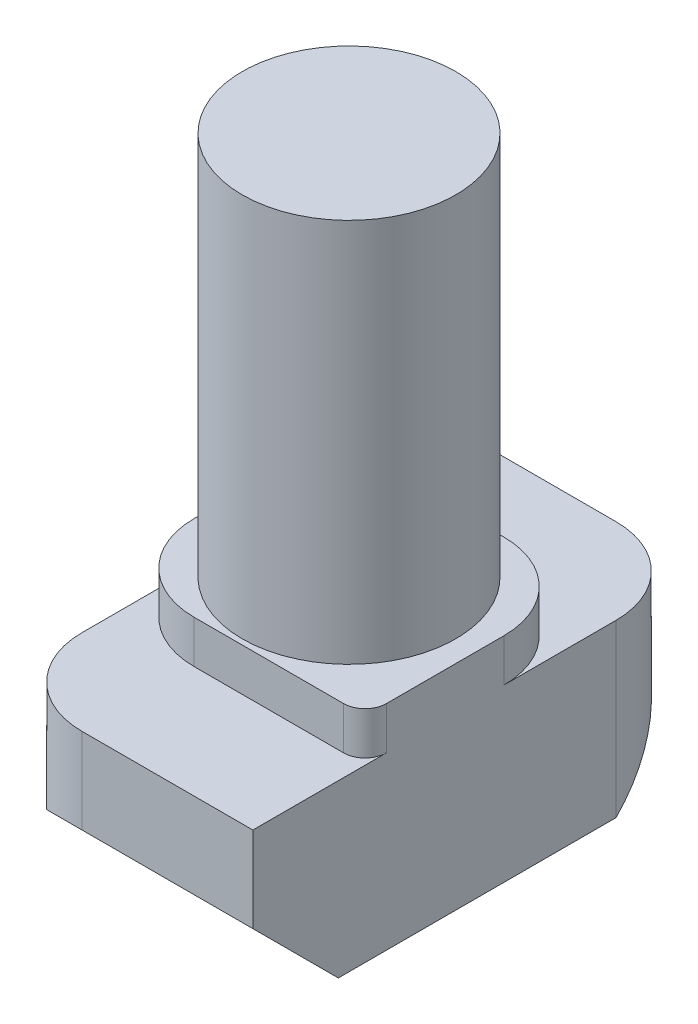
ISO-10303-21;
HEADER;
FILE_DESCRIPTION(('STEP AP214'),'2;1');
FILE_NAME('part.step','',(''),(''),'','','');
FILE_SCHEMA(('AUTOMOTIVE_DESIGN { 1 0 10303 214 1 1 1 1 }'));
ENDSEC;
DATA;
#1=APPLICATION_CONTEXT('core data for automotive mechanical design processes');
#2=APPLICATION_PROTOCOL_DEFINITION('international standard','automotive_design',2000,#1);
#3=PRODUCT_CONTEXT('',#1,'mechanical');
#4=PRODUCT('Part','Part','',(#3));
#5=PRODUCT_RELATED_PRODUCT_CATEGORY('part','',(#4));
#6=PRODUCT_DEFINITION_FORMATION('','',#4);
#7=PRODUCT_DEFINITION_CONTEXT('part definition',#1,'design');
#8=PRODUCT_DEFINITION('design','',#6,#7);
#9=PRODUCT_DEFINITION_SHAPE('','',#8);
#10=(LENGTH_UNIT() NAMED_UNIT(*) SI_UNIT(.MILLI.,.METRE.));
#11=(NAMED_UNIT(*) PLANE_ANGLE_UNIT() SI_UNIT($,.RADIAN.));
#12=(NAMED_UNIT(*) SI_UNIT($,.STERADIAN.) SOLID_ANGLE_UNIT());
#13=UNCERTAINTY_MEASURE_WITH_UNIT(LENGTH_MEASURE(1.E-05),#10,'distance_accuracy_value','');
#14=(GEOMETRIC_REPRESENTATION_CONTEXT(3) GLOBAL_UNCERTAINTY_ASSIGNED_CONTEXT((#13)) GLOBAL_UNIT_ASSIGNED_CONTEXT((#10,
#11,#12)) REPRESENTATION_CONTEXT('',''));
#15=CARTESIAN_POINT('',(0.,0.,0.));
#16=DIRECTION('',(0.,0.,1.));
#17=DIRECTION('',(1.,0.,0.));
#18=AXIS2_PLACEMENT_3D('',#15,#16,#17);
#19=CARTESIAN_POINT('',(3.,0.,2.625));
#20=DIRECTION('',(0.,-1.,0.));
#21=DIRECTION('',(0.,0.,-1.));
#22=AXIS2_PLACEMENT_3D('',#19,#20,#21);
#23=PLANE('',#22);
#24=DIRECTION('',(-1.,0.,0.));
#25=VECTOR('',#24,1.);
#26=CARTESIAN_POINT('',(3.,0.,-2.625));
#27=LINE('',#26,#25);
#28=CARTESIAN_POINT('',(1.,0.,-2.625));
#29=VERTEX_POINT('',#28);
#30=CARTESIAN_POINT('',(-2.5,0.,-2.625));
#31=VERTEX_POINT('',#30);
#32=EDGE_CURVE('E193',#29,#31,#27,.T.);
#33=ORIENTED_EDGE('',*,*,#32,.T.);
#34=CARTESIAN_POINT('',(-2.5,0.,-2.125));
#35=DIRECTION('',(0.,-1.,0.));
#36=DIRECTION('',(0.,0.,-1.));
#37=AXIS2_PLACEMENT_3D('',#34,#35,#36);
#38=CIRCLE('',#37,0.5);
#39=CARTESIAN_POINT('',(-3.,0.,-2.125));
#40=VERTEX_POINT('',#39);
#41=EDGE_CURVE('E254',#31,#40,#38,.F.);
#42=ORIENTED_EDGE('',*,*,#41,.T.);
#43=DIRECTION('',(0.,0.,1.));
#44=VECTOR('',#43,1.);
#45=CARTESIAN_POINT('',(-3.,0.,2.625));
#46=LINE('',#45,#44);
#47=CARTESIAN_POINT('',(-3.,0.,0.625000000000001));
#48=VERTEX_POINT('',#47);
#49=EDGE_CURVE('E148',#40,#48,#46,.T.);
#50=ORIENTED_EDGE('',*,*,#49,.T.);
#51=CARTESIAN_POINT('',(-1.,0.,0.625));
#52=DIRECTION('',(0.,-1.,0.));
#53=DIRECTION('',(0.,0.,-1.));
#54=AXIS2_PLACEMENT_3D('',#51,#52,#53);
#55=CIRCLE('',#54,2.);
#56=CARTESIAN_POINT('',(-1.,0.,2.625));
#57=VERTEX_POINT('',#56);
#58=EDGE_CURVE('E230',#48,#57,#55,.F.);
#59=ORIENTED_EDGE('',*,*,#58,.T.);
#60=DIRECTION('',(-1.,0.,0.));
#61=VECTOR('',#60,1.);
#62=CARTESIAN_POINT('',(3.,0.,2.625));
#63=LINE('',#62,#61);
#64=CARTESIAN_POINT('',(2.5,0.,2.625));
#65=VERTEX_POINT('',#64);
#66=EDGE_CURVE('E177',#65,#57,#63,.T.);
#67=ORIENTED_EDGE('',*,*,#66,.F.);
#68=CARTESIAN_POINT('',(2.5,0.,2.125));
#69=DIRECTION('',(0.,-1.,0.));
#70=DIRECTION('',(0.,0.,-1.));
#71=AXIS2_PLACEMENT_3D('',#68,#69,#70);
#72=CIRCLE('',#71,0.5);
#73=CARTESIAN_POINT('',(3.,0.,2.125));
#74=VERTEX_POINT('',#73);
#75=EDGE_CURVE('E252',#65,#74,#72,.F.);
#76=ORIENTED_EDGE('',*,*,#75,.T.);
#77=DIRECTION('',(0.,0.,1.));
#78=VECTOR('',#77,1.);
#79=CARTESIAN_POINT('',(3.,0.,2.625));
#80=LINE('',#79,#78);
#81=CARTESIAN_POINT('',(3.,0.,-0.624999999999999));
#82=VERTEX_POINT('',#81);
#83=EDGE_CURVE('E175',#82,#74,#80,.T.);
#84=ORIENTED_EDGE('',*,*,#83,.F.);
#85=CARTESIAN_POINT('',(1.,0.,-0.625));
#86=DIRECTION('',(0.,-1.,0.));
#87=DIRECTION('',(0.,0.,-1.));
#88=AXIS2_PLACEMENT_3D('',#85,#86,#87);
#89=CIRCLE('',#88,2.);
#90=EDGE_CURVE('E233',#82,#29,#89,.F.);
#91=ORIENTED_EDGE('',*,*,#90,.T.);
#92=EDGE_LOOP('',(#33,#42,#50,#59,#67,#76,#84,#91));
#93=FACE_BOUND('',#92,.T.);
#94=CARTESIAN_POINT('',(0.,0.,0.));
#95=DIRECTION('',(0.,-1.,0.));
#96=DIRECTION('',(0.,0.,-1.));
#97=AXIS2_PLACEMENT_3D('',#94,#95,#96);
#98=CIRCLE('',#97,2.5);
#99=CARTESIAN_POINT('',(0.,0.,-2.5));
#100=VERTEX_POINT('',#99);
#101=EDGE_CURVE('E11',#100,#100,#98,.F.);
#102=ORIENTED_EDGE('',*,*,#101,.F.);
#103=EDGE_LOOP('',(#102));
#104=FACE_BOUND('',#103,.T.);
#105=ADVANCED_FACE('F38',(#93,#104),#23,.F.);
#106=CARTESIAN_POINT('',(3.,-1.,2.625));
#107=DIRECTION('',(0.,0.,-1.));
#108=DIRECTION('',(-1.,0.,0.));
#109=AXIS2_PLACEMENT_3D('',#106,#107,#108);
#110=PLANE('',#109);
#111=DIRECTION('',(-1.,0.,0.));
#112=VECTOR('',#111,1.);
#113=CARTESIAN_POINT('',(3.,-1.,2.625));
#114=LINE('',#113,#112);
#115=CARTESIAN_POINT('',(2.5,-1.,2.625));
#116=VERTEX_POINT('',#115);
#117=CARTESIAN_POINT('',(-1.,-1.,2.625));
#118=VERTEX_POINT('',#117);
#119=EDGE_CURVE('E159',#116,#118,#114,.T.);
#120=ORIENTED_EDGE('',*,*,#119,.F.);
#121=DIRECTION('',(0.,-1.,0.));
#122=VECTOR('',#121,1.);
#123=CARTESIAN_POINT('',(2.5,-1.,2.625));
#124=LINE('',#123,#122);
#125=EDGE_CURVE('E260',#116,#65,#124,.F.);
#126=ORIENTED_EDGE('',*,*,#125,.T.);
#127=ORIENTED_EDGE('',*,*,#66,.T.);
#128=DIRECTION('',(0.,-1.,0.));
#129=VECTOR('',#128,1.);
#130=CARTESIAN_POINT('',(-1.,-1.,2.625));
#131=LINE('',#130,#129);
#132=EDGE_CURVE('E237',#57,#118,#131,.T.);
#133=ORIENTED_EDGE('',*,*,#132,.T.);
#134=EDGE_LOOP('',(#120,#126,#127,#133));
#135=FACE_BOUND('',#134,.T.);
#136=ADVANCED_FACE('F295',(#135),#110,.F.);
#137=CARTESIAN_POINT('',(3.,-1.,5.25));
#138=DIRECTION('',(0.,-1.,0.));
#139=DIRECTION('',(0.,0.,-1.));
#140=AXIS2_PLACEMENT_3D('',#137,#138,#139);
#141=PLANE('',#140);
#142=DIRECTION('',(0.,0.,1.));
#143=VECTOR('',#142,1.);
#144=CARTESIAN_POINT('',(-3.,-1.,5.25));
#145=LINE('',#144,#143);
#146=CARTESIAN_POINT('',(-3.,-1.,0.625));
#147=VERTEX_POINT('',#146);
#148=CARTESIAN_POINT('',(-3.,-1.,3.25));
#149=VERTEX_POINT('',#148);
#150=EDGE_CURVE('E178',#147,#149,#145,.T.);
#151=ORIENTED_EDGE('',*,*,#150,.T.);
#152=CARTESIAN_POINT('',(-1.,-1.,3.25));
#153=DIRECTION('',(0.,-1.,0.));
#154=DIRECTION('',(0.,0.,-1.));
#155=AXIS2_PLACEMENT_3D('',#152,#153,#154);
#156=CIRCLE('',#155,2.);
#157=CARTESIAN_POINT('',(-1.,-1.,5.25));
#158=VERTEX_POINT('',#157);
#159=EDGE_CURVE('E155',#149,#158,#156,.F.);
#160=ORIENTED_EDGE('',*,*,#159,.T.);
#161=DIRECTION('',(-1.,0.,0.));
#162=VECTOR('',#161,1.);
#163=CARTESIAN_POINT('',(3.,-1.,5.25));
#164=LINE('',#163,#162);
#165=CARTESIAN_POINT('',(3.,-1.,5.25));
#166=VERTEX_POINT('',#165);
#167=EDGE_CURVE('E151',#166,#158,#164,.T.);
#168=ORIENTED_EDGE('',*,*,#167,.F.);
#169=DIRECTION('',(0.,0.,1.));
#170=VECTOR('',#169,1.);
#171=CARTESIAN_POINT('',(3.,-1.,5.25));
#172=LINE('',#171,#170);
#173=CARTESIAN_POINT('',(3.,-1.,2.125));
#174=VERTEX_POINT('',#173);
#175=EDGE_CURVE('E57',#174,#166,#172,.T.);
#176=ORIENTED_EDGE('',*,*,#175,.F.);
#177=CARTESIAN_POINT('',(2.5,-1.,2.125));
#178=DIRECTION('',(0.,-1.,0.));
#179=DIRECTION('',(0.,0.,-1.));
#180=AXIS2_PLACEMENT_3D('',#177,#178,#179);
#181=CIRCLE('',#180,0.5);
#182=EDGE_CURVE('E46',#174,#116,#181,.T.);
#183=ORIENTED_EDGE('',*,*,#182,.T.);
#184=ORIENTED_EDGE('',*,*,#119,.T.);
#185=CARTESIAN_POINT('',(-1.,-1.,0.625));
#186=DIRECTION('',(0.,-1.,0.));
#187=DIRECTION('',(0.,0.,-1.));
#188=AXIS2_PLACEMENT_3D('',#185,#186,#187);
#189=CIRCLE('',#188,2.);
#190=EDGE_CURVE('E246',#118,#147,#189,.T.);
#191=ORIENTED_EDGE('',*,*,#190,.T.);
#192=EDGE_LOOP('',(#151,#160,#168,#176,#183,#184,#191));
#193=FACE_BOUND('',#192,.T.);
#194=ADVANCED_FACE('F153',(#193),#141,.F.);
#195=CARTESIAN_POINT('',(3.,-3.,5.25));
#196=DIRECTION('',(0.,0.,-1.));
#197=DIRECTION('',(-1.,0.,0.));
#198=AXIS2_PLACEMENT_3D('',#195,#196,#197);
#199=PLANE('',#198);
#200=ORIENTED_EDGE('',*,*,#167,.T.);
#201=DIRECTION('',(0.,-1.,0.));
#202=VECTOR('',#201,1.);
#203=CARTESIAN_POINT('',(-1.,-3.,5.25));
#204=LINE('',#203,#202);
#205=CARTESIAN_POINT('',(-1.,-3.,5.25));
#206=VERTEX_POINT('',#205);
#207=EDGE_CURVE('E220',#158,#206,#204,.T.);
#208=ORIENTED_EDGE('',*,*,#207,.T.);
#209=DIRECTION('',(-1.,0.,0.));
#210=VECTOR('',#209,1.);
#211=CARTESIAN_POINT('',(3.,-3.,5.25));
#212=LINE('',#211,#210);
#213=CARTESIAN_POINT('',(3.,-3.,5.25));
#214=VERTEX_POINT('',#213);
#215=EDGE_CURVE('E160',#214,#206,#212,.T.);
#216=ORIENTED_EDGE('',*,*,#215,.F.);
#217=DIRECTION('',(0.,-1.,0.));
#218=VECTOR('',#217,1.);
#219=CARTESIAN_POINT('',(3.,-3.,5.25));
#220=LINE('',#219,#218);
#221=EDGE_CURVE('E144',#166,#214,#220,.T.);
#222=ORIENTED_EDGE('',*,*,#221,.F.);
#223=EDGE_LOOP('',(#200,#208,#216,#222));
#224=FACE_BOUND('',#223,.T.);
#225=ADVANCED_FACE('F162',(#224),#199,.F.);
#226=CARTESIAN_POINT('',(3.,-5.,3.25));
#227=DIRECTION('',(0.,0.707106781186546,-0.707106781186549));
#228=DIRECTION('',(0.,0.707106781186549,0.707106781186546));
#229=AXIS2_PLACEMENT_3D('',#226,#227,#228);
#230=PLANE('',#229);
#231=ORIENTED_EDGE('',*,*,#215,.T.);
#232=CARTESIAN_POINT('',(-1.,-5.00000000000001,3.25));
#233=DIRECTION('',(0.,0.707106781186546,-0.707106781186549));
#234=DIRECTION('',(0.,0.707106781186549,0.707106781186546));
#235=AXIS2_PLACEMENT_3D('',#232,#233,#234);
#236=ELLIPSE('',#235,2.82842712474619,2.);
#237=CARTESIAN_POINT('',(-3.,-5.,3.25));
#238=VERTEX_POINT('',#237);
#239=EDGE_CURVE('E222',#206,#238,#236,.F.);
#240=ORIENTED_EDGE('',*,*,#239,.T.);
#241=DIRECTION('',(-1.,0.,0.));
#242=VECTOR('',#241,1.);
#243=CARTESIAN_POINT('',(3.,-5.,3.25));
#244=LINE('',#243,#242);
#245=CARTESIAN_POINT('',(3.,-5.,3.25));
#246=VERTEX_POINT('',#245);
#247=EDGE_CURVE('E206',#246,#238,#244,.T.);
#248=ORIENTED_EDGE('',*,*,#247,.F.);
#249=DIRECTION('',(0.,-0.707106781186549,-0.707106781186546));
#250=VECTOR('',#249,1.);
#251=CARTESIAN_POINT('',(3.,-5.,3.25));
#252=LINE('',#251,#250);
#253=EDGE_CURVE('E165',#214,#246,#252,.T.);
#254=ORIENTED_EDGE('',*,*,#253,.F.);
#255=EDGE_LOOP('',(#231,#240,#248,#254));
#256=FACE_BOUND('',#255,.T.);
#257=ADVANCED_FACE('F300',(#256),#230,.F.);
#258=CARTESIAN_POINT('',(3.,-5.,-3.24999999999999));
#259=DIRECTION('',(0.,1.,0.));
#260=DIRECTION('',(0.,0.,1.));
#261=AXIS2_PLACEMENT_3D('',#258,#259,#260);
#262=PLANE('',#261);
#263=DIRECTION('',(0.,0.,-1.));
#264=VECTOR('',#263,1.);
#265=CARTESIAN_POINT('',(-3.,-5.,-3.24999999999999));
#266=LINE('',#265,#264);
#267=CARTESIAN_POINT('',(-3.,-5.,-3.24999999999999));
#268=VERTEX_POINT('',#267);
#269=EDGE_CURVE('E180',#238,#268,#266,.T.);
#270=ORIENTED_EDGE('',*,*,#269,.T.);
#271=DIRECTION('',(-1.,0.,0.));
#272=VECTOR('',#271,1.);
#273=CARTESIAN_POINT('',(3.,-5.,-3.24999999999999));
#274=LINE('',#273,#272);
#275=CARTESIAN_POINT('',(3.,-5.,-3.24999999999999));
#276=VERTEX_POINT('',#275);
#277=EDGE_CURVE('E203',#276,#268,#274,.T.);
#278=ORIENTED_EDGE('',*,*,#277,.F.);
#279=DIRECTION('',(0.,0.,-1.));
#280=VECTOR('',#279,1.);
#281=CARTESIAN_POINT('',(3.,-5.,-3.24999999999999));
#282=LINE('',#281,#280);
#283=EDGE_CURVE('E167',#246,#276,#282,.T.);
#284=ORIENTED_EDGE('',*,*,#283,.F.);
#285=ORIENTED_EDGE('',*,*,#247,.T.);
#286=EDGE_LOOP('',(#270,#278,#284,#285));
#287=FACE_BOUND('',#286,.T.);
#288=ADVANCED_FACE('F306',(#287),#262,.F.);
#289=CARTESIAN_POINT('',(3.,-3.,-5.25));
#290=DIRECTION('',(0.,0.707106781186548,0.707106781186547));
#291=DIRECTION('',(0.,-0.707106781186547,0.707106781186548));
#292=AXIS2_PLACEMENT_3D('',#289,#290,#291);
#293=PLANE('',#292);
#294=DIRECTION('',(-1.,0.,0.));
#295=VECTOR('',#294,1.);
#296=CARTESIAN_POINT('',(3.,-3.,-5.25));
#297=LINE('',#296,#295);
#298=CARTESIAN_POINT('',(1.,-3.,-5.25));
#299=VERTEX_POINT('',#298);
#300=CARTESIAN_POINT('',(-3.,-3.,-5.25));
#301=VERTEX_POINT('',#300);
#302=EDGE_CURVE('E201',#299,#301,#297,.T.);
#303=ORIENTED_EDGE('',*,*,#302,.F.);
#304=CARTESIAN_POINT('',(1.,-4.99999999999999,-3.25));
#305=DIRECTION('',(0.,0.707106781186548,0.707106781186547));
#306=DIRECTION('',(0.,0.707106781186547,-0.707106781186548));
#307=AXIS2_PLACEMENT_3D('',#304,#305,#306);
#308=ELLIPSE('',#307,2.82842712474619,2.);
#309=EDGE_CURVE('E218',#299,#276,#308,.F.);
#310=ORIENTED_EDGE('',*,*,#309,.T.);
#311=ORIENTED_EDGE('',*,*,#277,.T.);
#312=DIRECTION('',(0.,0.707106781186547,-0.707106781186548));
#313=VECTOR('',#312,1.);
#314=CARTESIAN_POINT('',(-3.,-3.,-5.25));
#315=LINE('',#314,#313);
#316=EDGE_CURVE('E183',#268,#301,#315,.T.);
#317=ORIENTED_EDGE('',*,*,#316,.T.);
#318=EDGE_LOOP('',(#303,#310,#311,#317));
#319=FACE_BOUND('',#318,.T.);
#320=ADVANCED_FACE('F319',(#319),#293,.F.);
#321=CARTESIAN_POINT('',(3.,-1.,-5.25));
#322=DIRECTION('',(0.,0.,1.));
#323=DIRECTION('',(1.,0.,0.));
#324=AXIS2_PLACEMENT_3D('',#321,#322,#323);
#325=PLANE('',#324);
#326=DIRECTION('',(-1.,0.,0.));
#327=VECTOR('',#326,1.);
#328=CARTESIAN_POINT('',(3.,-1.,-5.25));
#329=LINE('',#328,#327);
#330=CARTESIAN_POINT('',(1.,-1.,-5.25));
#331=VERTEX_POINT('',#330);
#332=CARTESIAN_POINT('',(-3.,-1.,-5.25));
#333=VERTEX_POINT('',#332);
#334=EDGE_CURVE('E199',#331,#333,#329,.T.);
#335=ORIENTED_EDGE('',*,*,#334,.F.);
#336=DIRECTION('',(0.,1.,0.));
#337=VECTOR('',#336,1.);
#338=CARTESIAN_POINT('',(1.,-1.,-5.25));
#339=LINE('',#338,#337);
#340=EDGE_CURVE('E216',#331,#299,#339,.F.);
#341=ORIENTED_EDGE('',*,*,#340,.T.);
#342=ORIENTED_EDGE('',*,*,#302,.T.);
#343=DIRECTION('',(0.,1.,0.));
#344=VECTOR('',#343,1.);
#345=CARTESIAN_POINT('',(-3.,-1.,-5.25));
#346=LINE('',#345,#344);
#347=EDGE_CURVE('E186',#301,#333,#346,.T.);
#348=ORIENTED_EDGE('',*,*,#347,.T.);
#349=EDGE_LOOP('',(#335,#341,#342,#348));
#350=FACE_BOUND('',#349,.T.);
#351=ADVANCED_FACE('F316',(#350),#325,.F.);
#352=CARTESIAN_POINT('',(3.,-1.,-2.625));
#353=DIRECTION('',(0.,-1.,0.));
#354=DIRECTION('',(0.,0.,-1.));
#355=AXIS2_PLACEMENT_3D('',#352,#353,#354);
#356=PLANE('',#355);
#357=DIRECTION('',(0.,0.,1.));
#358=VECTOR('',#357,1.);
#359=CARTESIAN_POINT('',(3.,-1.,-2.625));
#360=LINE('',#359,#358);
#361=CARTESIAN_POINT('',(3.,-1.,-3.25));
#362=VERTEX_POINT('',#361);
#363=CARTESIAN_POINT('',(3.,-1.,-0.625));
#364=VERTEX_POINT('',#363);
#365=EDGE_CURVE('E173',#362,#364,#360,.T.);
#366=ORIENTED_EDGE('',*,*,#365,.F.);
#367=CARTESIAN_POINT('',(1.,-1.,-3.25));
#368=DIRECTION('',(0.,-1.,0.));
#369=DIRECTION('',(0.,0.,-1.));
#370=AXIS2_PLACEMENT_3D('',#367,#368,#369);
#371=CIRCLE('',#370,2.);
#372=EDGE_CURVE('E214',#362,#331,#371,.F.);
#373=ORIENTED_EDGE('',*,*,#372,.T.);
#374=ORIENTED_EDGE('',*,*,#334,.T.);
#375=DIRECTION('',(0.,0.,1.));
#376=VECTOR('',#375,1.);
#377=CARTESIAN_POINT('',(-3.,-1.,-2.625));
#378=LINE('',#377,#376);
#379=CARTESIAN_POINT('',(-3.,-1.,-2.125));
#380=VERTEX_POINT('',#379);
#381=EDGE_CURVE('E189',#333,#380,#378,.T.);
#382=ORIENTED_EDGE('',*,*,#381,.T.);
#383=CARTESIAN_POINT('',(-2.5,-1.,-2.125));
#384=DIRECTION('',(0.,-1.,0.));
#385=DIRECTION('',(0.,0.,-1.));
#386=AXIS2_PLACEMENT_3D('',#383,#384,#385);
#387=CIRCLE('',#386,0.5);
#388=CARTESIAN_POINT('',(-2.5,-1.,-2.625));
#389=VERTEX_POINT('',#388);
#390=EDGE_CURVE('E262',#380,#389,#387,.T.);
#391=ORIENTED_EDGE('',*,*,#390,.T.);
#392=DIRECTION('',(-1.,0.,0.));
#393=VECTOR('',#392,1.);
#394=CARTESIAN_POINT('',(3.,-1.,-2.625));
#395=LINE('',#394,#393);
#396=CARTESIAN_POINT('',(1.,-1.,-2.625));
#397=VERTEX_POINT('',#396);
#398=EDGE_CURVE('E196',#397,#389,#395,.T.);
#399=ORIENTED_EDGE('',*,*,#398,.F.);
#400=CARTESIAN_POINT('',(1.,-1.,-0.625));
#401=DIRECTION('',(0.,-1.,0.));
#402=DIRECTION('',(0.,0.,-1.));
#403=AXIS2_PLACEMENT_3D('',#400,#401,#402);
#404=CIRCLE('',#403,2.);
#405=EDGE_CURVE('E243',#397,#364,#404,.T.);
#406=ORIENTED_EDGE('',*,*,#405,.T.);
#407=EDGE_LOOP('',(#366,#373,#374,#382,#391,#399,#406));
#408=FACE_BOUND('',#407,.T.);
#409=ADVANCED_FACE('F267',(#408),#356,.F.);
#410=CARTESIAN_POINT('',(3.,0.,-2.625));
#411=DIRECTION('',(0.,0.,1.));
#412=DIRECTION('',(1.,0.,0.));
#413=AXIS2_PLACEMENT_3D('',#410,#411,#412);
#414=PLANE('',#413);
#415=ORIENTED_EDGE('',*,*,#398,.T.);
#416=DIRECTION('',(0.,1.,0.));
#417=VECTOR('',#416,1.);
#418=CARTESIAN_POINT('',(-2.5,0.,-2.625));
#419=LINE('',#418,#417);
#420=EDGE_CURVE('E249',#389,#31,#419,.T.);
#421=ORIENTED_EDGE('',*,*,#420,.T.);
#422=ORIENTED_EDGE('',*,*,#32,.F.);
#423=DIRECTION('',(0.,1.,0.));
#424=VECTOR('',#423,1.);
#425=CARTESIAN_POINT('',(1.,0.,-2.625));
#426=LINE('',#425,#424);
#427=EDGE_CURVE('E235',#29,#397,#426,.F.);
#428=ORIENTED_EDGE('',*,*,#427,.T.);
#429=EDGE_LOOP('',(#415,#421,#422,#428));
#430=FACE_BOUND('',#429,.T.);
#431=ADVANCED_FACE('F274',(#430),#414,.F.);
#432=CARTESIAN_POINT('',(3.,0.,0.));
#433=DIRECTION('',(-1.,0.,0.));
#434=DIRECTION('',(0.,0.,1.));
#435=AXIS2_PLACEMENT_3D('',#432,#433,#434);
#436=PLANE('',#435);
#437=ORIENTED_EDGE('',*,*,#83,.T.);
#438=DIRECTION('',(0.,-1.,0.));
#439=VECTOR('',#438,1.);
#440=CARTESIAN_POINT('',(3.,0.,2.125));
#441=LINE('',#440,#439);
#442=EDGE_CURVE('E147',#74,#174,#441,.T.);
#443=ORIENTED_EDGE('',*,*,#442,.T.);
#444=ORIENTED_EDGE('',*,*,#175,.T.);
#445=ORIENTED_EDGE('',*,*,#221,.T.);
#446=ORIENTED_EDGE('',*,*,#253,.T.);
#447=ORIENTED_EDGE('',*,*,#283,.T.);
#448=DIRECTION('',(0.,1.,0.));
#449=VECTOR('',#448,1.);
#450=CARTESIAN_POINT('',(3.,0.,-3.25));
#451=LINE('',#450,#449);
#452=EDGE_CURVE('E211',#276,#362,#451,.T.);
#453=ORIENTED_EDGE('',*,*,#452,.T.);
#454=ORIENTED_EDGE('',*,*,#365,.T.);
#455=DIRECTION('',(0.,1.,0.));
#456=VECTOR('',#455,1.);
#457=CARTESIAN_POINT('',(3.,0.,-0.625));
#458=LINE('',#457,#456);
#459=EDGE_CURVE('E227',#364,#82,#458,.T.);
#460=ORIENTED_EDGE('',*,*,#459,.T.);
#461=EDGE_LOOP('',(#437,#443,#444,#445,#446,#447,#453,#454,#460));
#462=FACE_BOUND('',#461,.T.);
#463=ADVANCED_FACE('F142',(#462),#436,.F.);
#464=CARTESIAN_POINT('',(-3.,0.,0.));
#465=DIRECTION('',(-1.,0.,0.));
#466=DIRECTION('',(0.,0.,1.));
#467=AXIS2_PLACEMENT_3D('',#464,#465,#466);
#468=PLANE('',#467);
#469=ORIENTED_EDGE('',*,*,#49,.F.);
#470=DIRECTION('',(0.,1.,0.));
#471=VECTOR('',#470,1.);
#472=CARTESIAN_POINT('',(-3.,-1.,-2.125));
#473=LINE('',#472,#471);
#474=EDGE_CURVE('E256',#40,#380,#473,.F.);
#475=ORIENTED_EDGE('',*,*,#474,.T.);
#476=ORIENTED_EDGE('',*,*,#381,.F.);
#477=ORIENTED_EDGE('',*,*,#347,.F.);
#478=ORIENTED_EDGE('',*,*,#316,.F.);
#479=ORIENTED_EDGE('',*,*,#269,.F.);
#480=DIRECTION('',(0.,-1.,0.));
#481=VECTOR('',#480,1.);
#482=CARTESIAN_POINT('',(-3.,-1.,3.25));
#483=LINE('',#482,#481);
#484=EDGE_CURVE('E224',#238,#149,#483,.F.);
#485=ORIENTED_EDGE('',*,*,#484,.T.);
#486=ORIENTED_EDGE('',*,*,#150,.F.);
#487=DIRECTION('',(0.,-1.,0.));
#488=VECTOR('',#487,1.);
#489=CARTESIAN_POINT('',(-3.,0.,0.625));
#490=LINE('',#489,#488);
#491=EDGE_CURVE('E240',#147,#48,#490,.F.);
#492=ORIENTED_EDGE('',*,*,#491,.T.);
#493=EDGE_LOOP('',(#469,#475,#476,#477,#478,#479,#485,#486,#492));
#494=FACE_BOUND('',#493,.T.);
#495=ADVANCED_FACE('F282',(#494),#468,.T.);
#496=CARTESIAN_POINT('',(1.,0.,-3.25));
#497=DIRECTION('',(0.,1.,0.));
#498=DIRECTION('',(0.,0.,1.));
#499=AXIS2_PLACEMENT_3D('',#496,#497,#498);
#500=CYLINDRICAL_SURFACE('',#499,2.);
#501=ORIENTED_EDGE('',*,*,#309,.F.);
#502=ORIENTED_EDGE('',*,*,#340,.F.);
#503=ORIENTED_EDGE('',*,*,#372,.F.);
#504=ORIENTED_EDGE('',*,*,#452,.F.);
#505=EDGE_LOOP('',(#501,#502,#503,#504));
#506=FACE_BOUND('',#505,.T.);
#507=ADVANCED_FACE('F312',(#506),#500,.T.);
#508=CARTESIAN_POINT('',(-1.,-3.,3.25));
#509=DIRECTION('',(0.,1.,0.));
#510=DIRECTION('',(0.,0.,1.));
#511=AXIS2_PLACEMENT_3D('',#508,#509,#510);
#512=CYLINDRICAL_SURFACE('',#511,2.);
#513=ORIENTED_EDGE('',*,*,#159,.F.);
#514=ORIENTED_EDGE('',*,*,#484,.F.);
#515=ORIENTED_EDGE('',*,*,#239,.F.);
#516=ORIENTED_EDGE('',*,*,#207,.F.);
#517=EDGE_LOOP('',(#513,#514,#515,#516));
#518=FACE_BOUND('',#517,.T.);
#519=ADVANCED_FACE('F298',(#518),#512,.T.);
#520=CARTESIAN_POINT('',(1.,0.,-0.625));
#521=DIRECTION('',(0.,1.,0.));
#522=DIRECTION('',(0.,0.,1.));
#523=AXIS2_PLACEMENT_3D('',#520,#521,#522);
#524=CYLINDRICAL_SURFACE('',#523,2.);
#525=ORIENTED_EDGE('',*,*,#405,.F.);
#526=ORIENTED_EDGE('',*,*,#427,.F.);
#527=ORIENTED_EDGE('',*,*,#90,.F.);
#528=ORIENTED_EDGE('',*,*,#459,.F.);
#529=EDGE_LOOP('',(#525,#526,#527,#528));
#530=FACE_BOUND('',#529,.T.);
#531=ADVANCED_FACE('F372',(#530),#524,.T.);
#532=CARTESIAN_POINT('',(-1.,-1.,0.625));
#533=DIRECTION('',(0.,1.,0.));
#534=DIRECTION('',(0.,0.,1.));
#535=AXIS2_PLACEMENT_3D('',#532,#533,#534);
#536=CYLINDRICAL_SURFACE('',#535,2.);
#537=ORIENTED_EDGE('',*,*,#58,.F.);
#538=ORIENTED_EDGE('',*,*,#491,.F.);
#539=ORIENTED_EDGE('',*,*,#190,.F.);
#540=ORIENTED_EDGE('',*,*,#132,.F.);
#541=EDGE_LOOP('',(#537,#538,#539,#540));
#542=FACE_BOUND('',#541,.T.);
#543=ADVANCED_FACE('F288',(#542),#536,.T.);
#544=CARTESIAN_POINT('',(-2.5,0.,-2.125));
#545=DIRECTION('',(0.,-1.,0.));
#546=DIRECTION('',(0.,0.,-1.));
#547=AXIS2_PLACEMENT_3D('',#544,#545,#546);
#548=CYLINDRICAL_SURFACE('',#547,0.5);
#549=ORIENTED_EDGE('',*,*,#390,.F.);
#550=ORIENTED_EDGE('',*,*,#474,.F.);
#551=ORIENTED_EDGE('',*,*,#41,.F.);
#552=ORIENTED_EDGE('',*,*,#420,.F.);
#553=EDGE_LOOP('',(#549,#550,#551,#552));
#554=FACE_BOUND('',#553,.T.);
#555=ADVANCED_FACE('F277',(#554),#548,.T.);
#556=CARTESIAN_POINT('',(2.5,0.,2.125));
#557=DIRECTION('',(0.,-1.,0.));
#558=DIRECTION('',(0.,0.,-1.));
#559=AXIS2_PLACEMENT_3D('',#556,#557,#558);
#560=CYLINDRICAL_SURFACE('',#559,0.5);
#561=ORIENTED_EDGE('',*,*,#75,.F.);
#562=ORIENTED_EDGE('',*,*,#125,.F.);
#563=ORIENTED_EDGE('',*,*,#182,.F.);
#564=ORIENTED_EDGE('',*,*,#442,.F.);
#565=EDGE_LOOP('',(#561,#562,#563,#564));
#566=FACE_BOUND('',#565,.T.);
#567=ADVANCED_FACE('F40',(#566),#560,.T.);
#568=CARTESIAN_POINT('',(0.,55.,0.));
#569=DIRECTION('',(0.,1.,0.));
#570=DIRECTION('',(0.,0.,1.));
#571=AXIS2_PLACEMENT_3D('',#568,#569,#570);
#572=CYLINDRICAL_SURFACE('',#571,2.5);
#573=CARTESIAN_POINT('',(0.,9.,0.));
#574=DIRECTION('',(0.,1.,0.));
#575=DIRECTION('',(0.,0.,1.));
#576=AXIS2_PLACEMENT_3D('',#573,#574,#575);
#577=CIRCLE('',#576,2.5);
#578=CARTESIAN_POINT('',(0.,9.,2.5));
#579=VERTEX_POINT('',#578);
#580=EDGE_CURVE('E181',#579,#579,#577,.T.);
#581=ORIENTED_EDGE('',*,*,#580,.F.);
#582=EDGE_LOOP('',(#581));
#583=FACE_BOUND('',#582,.T.);
#584=ORIENTED_EDGE('',*,*,#101,.T.);
#585=EDGE_LOOP('',(#584));
#586=FACE_BOUND('',#585,.T.);
#587=ADVANCED_FACE('F397',(#583,#586),#572,.T.);
#588=CARTESIAN_POINT('',(2.5,9.,0.));
#589=DIRECTION('',(0.,-1.,0.));
#590=DIRECTION('',(0.,0.,-1.));
#591=AXIS2_PLACEMENT_3D('',#588,#589,#590);
#592=PLANE('',#591);
#593=ORIENTED_EDGE('',*,*,#580,.T.);
#594=EDGE_LOOP('',(#593));
#595=FACE_BOUND('',#594,.T.);
#596=ADVANCED_FACE('F403',(#595),#592,.F.);
#597=CLOSED_SHELL('',(#105,#136,#194,#225,#257,#288,#320,#351,#409,#431,#463,#495,#507,#519,
#531,#543,#555,#567,#587,#596));
#598=MANIFOLD_SOLID_BREP('B2',#597);
#599=ADVANCED_BREP_SHAPE_REPRESENTATION('',(#18,#598),#14);
#600=SHAPE_DEFINITION_REPRESENTATION(#9,#599);
ENDSEC;
END-ISO-10303-21;
